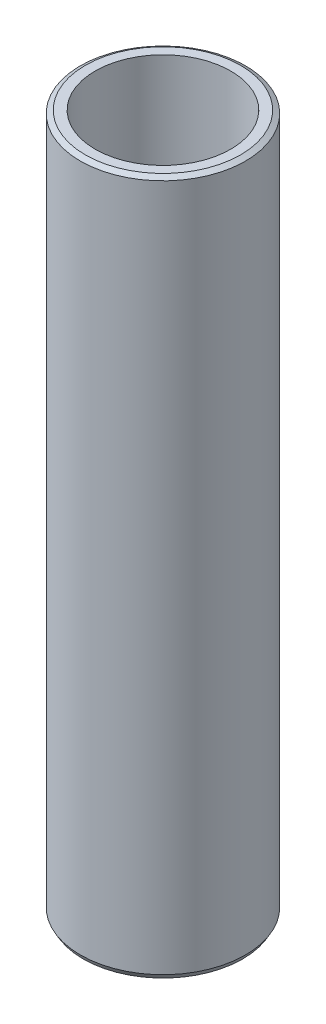
ISO-10303-21;
HEADER;
FILE_DESCRIPTION(('STEP AP214'),'2;1');
FILE_NAME('part.step','',(''),(''),'','','');
FILE_SCHEMA(('AUTOMOTIVE_DESIGN { 1 0 10303 214 1 1 1 1 }'));
ENDSEC;
DATA;
#1=APPLICATION_CONTEXT('core data for automotive mechanical design processes');
#2=APPLICATION_PROTOCOL_DEFINITION('international standard','automotive_design',2000,#1);
#3=PRODUCT_CONTEXT('',#1,'mechanical');
#4=PRODUCT('Part','Part','',(#3));
#5=PRODUCT_RELATED_PRODUCT_CATEGORY('part','',(#4));
#6=PRODUCT_DEFINITION_FORMATION('','',#4);
#7=PRODUCT_DEFINITION_CONTEXT('part definition',#1,'design');
#8=PRODUCT_DEFINITION('design','',#6,#7);
#9=PRODUCT_DEFINITION_SHAPE('','',#8);
#10=(LENGTH_UNIT() NAMED_UNIT(*) SI_UNIT(.MILLI.,.METRE.));
#11=(NAMED_UNIT(*) PLANE_ANGLE_UNIT() SI_UNIT($,.RADIAN.));
#12=(NAMED_UNIT(*) SI_UNIT($,.STERADIAN.) SOLID_ANGLE_UNIT());
#13=UNCERTAINTY_MEASURE_WITH_UNIT(LENGTH_MEASURE(1.E-05),#10,'distance_accuracy_value','');
#14=(GEOMETRIC_REPRESENTATION_CONTEXT(3) GLOBAL_UNCERTAINTY_ASSIGNED_CONTEXT((#13)) GLOBAL_UNIT_ASSIGNED_CONTEXT((#10,
#11,#12)) REPRESENTATION_CONTEXT('',''));
#15=CARTESIAN_POINT('',(0.,0.,0.));
#16=DIRECTION('',(0.,0.,1.));
#17=DIRECTION('',(1.,0.,0.));
#18=AXIS2_PLACEMENT_3D('',#15,#16,#17);
#19=CARTESIAN_POINT('',(0.,315.74827868934,0.));
#20=DIRECTION('',(0.,-1.,0.));
#21=DIRECTION('',(0.,0.,-1.));
#22=AXIS2_PLACEMENT_3D('',#19,#20,#21);
#23=CYLINDRICAL_SURFACE('',#22,37.5);
#24=CARTESIAN_POINT('',(0.,314.442957235542,0.));
#25=DIRECTION('',(0.,1.,0.));
#26=DIRECTION('',(0.,0.,1.));
#27=AXIS2_PLACEMENT_3D('',#24,#25,#26);
#28=CIRCLE('',#27,37.5);
#29=CARTESIAN_POINT('',(0.,314.442957235542,37.5));
#30=VERTEX_POINT('',#29);
#31=EDGE_CURVE('E50',#30,#30,#28,.F.);
#32=ORIENTED_EDGE('',*,*,#31,.T.);
#33=EDGE_LOOP('',(#32));
#34=FACE_BOUND('',#33,.T.);
#35=CARTESIAN_POINT('',(0.,2.26088307818717,0.));
#36=DIRECTION('',(0.,1.,0.));
#37=DIRECTION('',(0.,0.,1.));
#38=AXIS2_PLACEMENT_3D('',#35,#36,#37);
#39=CIRCLE('',#38,37.5);
#40=CARTESIAN_POINT('',(0.,2.26088307818717,37.5));
#41=VERTEX_POINT('',#40);
#42=EDGE_CURVE('E51',#41,#41,#39,.T.);
#43=ORIENTED_EDGE('',*,*,#42,.T.);
#44=EDGE_LOOP('',(#43));
#45=FACE_BOUND('',#44,.T.);
#46=ADVANCED_FACE('F39',(#34,#45),#23,.T.);
#47=CARTESIAN_POINT('',(0.,315.74827868934,0.));
#48=DIRECTION('',(0.,1.,0.));
#49=DIRECTION('',(0.,0.,1.));
#50=AXIS2_PLACEMENT_3D('',#47,#48,#49);
#51=PLANE('',#50);
#52=CARTESIAN_POINT('',(0.,315.74827868934,0.));
#53=DIRECTION('',(0.,1.,0.));
#54=DIRECTION('',(0.,0.,1.));
#55=AXIS2_PLACEMENT_3D('',#52,#53,#54);
#56=CIRCLE('',#55,35.2391169218127);
#57=CARTESIAN_POINT('',(0.,315.74827868934,35.2391169218127));
#58=VERTEX_POINT('',#57);
#59=EDGE_CURVE('E54',#58,#58,#56,.T.);
#60=ORIENTED_EDGE('',*,*,#59,.T.);
#61=EDGE_LOOP('',(#60));
#62=FACE_BOUND('',#61,.T.);
#63=CARTESIAN_POINT('',(0.,315.74827868934,0.));
#64=DIRECTION('',(0.,1.,0.));
#65=DIRECTION('',(0.,0.,1.));
#66=AXIS2_PLACEMENT_3D('',#63,#64,#65);
#67=CIRCLE('',#66,30.7841764514968);
#68=CARTESIAN_POINT('',(0.,315.74827868934,30.7841764514968));
#69=VERTEX_POINT('',#68);
#70=EDGE_CURVE('E58',#69,#69,#67,.T.);
#71=ORIENTED_EDGE('',*,*,#70,.F.);
#72=EDGE_LOOP('',(#71));
#73=FACE_BOUND('',#72,.T.);
#74=ADVANCED_FACE('F69',(#62,#73),#51,.T.);
#75=CARTESIAN_POINT('',(0.,0.,0.));
#76=DIRECTION('',(0.,1.,0.));
#77=DIRECTION('',(0.,0.,1.));
#78=AXIS2_PLACEMENT_3D('',#75,#76,#77);
#79=PLANE('',#78);
#80=CARTESIAN_POINT('',(0.,0.,0.));
#81=DIRECTION('',(0.,1.,0.));
#82=DIRECTION('',(0.,0.,1.));
#83=AXIS2_PLACEMENT_3D('',#80,#81,#82);
#84=CIRCLE('',#83,36.1946785462024);
#85=CARTESIAN_POINT('',(0.,0.,36.1946785462024));
#86=VERTEX_POINT('',#85);
#87=EDGE_CURVE('E10',#86,#86,#84,.F.);
#88=ORIENTED_EDGE('',*,*,#87,.T.);
#89=EDGE_LOOP('',(#88));
#90=FACE_BOUND('',#89,.T.);
#91=CARTESIAN_POINT('',(0.,0.,0.));
#92=DIRECTION('',(0.,1.,0.));
#93=DIRECTION('',(0.,0.,1.));
#94=AXIS2_PLACEMENT_3D('',#91,#92,#93);
#95=CIRCLE('',#94,30.7841764514968);
#96=CARTESIAN_POINT('',(0.,0.,30.7841764514968));
#97=VERTEX_POINT('',#96);
#98=EDGE_CURVE('E63',#97,#97,#95,.T.);
#99=ORIENTED_EDGE('',*,*,#98,.T.);
#100=EDGE_LOOP('',(#99));
#101=FACE_BOUND('',#100,.T.);
#102=ADVANCED_FACE('F75',(#90,#101),#79,.F.);
#103=CARTESIAN_POINT('',(0.,315.74827868934,0.));
#104=DIRECTION('',(0.,-1.,0.));
#105=DIRECTION('',(0.,0.,-1.));
#106=AXIS2_PLACEMENT_3D('',#103,#104,#105);
#107=CYLINDRICAL_SURFACE('',#106,30.7841764514968);
#108=ORIENTED_EDGE('',*,*,#70,.T.);
#109=EDGE_LOOP('',(#108));
#110=FACE_BOUND('',#109,.T.);
#111=ORIENTED_EDGE('',*,*,#98,.F.);
#112=EDGE_LOOP('',(#111));
#113=FACE_BOUND('',#112,.T.);
#114=ADVANCED_FACE('F70',(#110,#113),#107,.F.);
#115=CARTESIAN_POINT('',(0.,315.74827868934,0.));
#116=DIRECTION('',(0.,-1.,0.));
#117=DIRECTION('',(0.,0.,-1.));
#118=AXIS2_PLACEMENT_3D('',#115,#116,#117);
#119=CONICAL_SURFACE('',#118,35.2391169218127,1.0471975511966);
#120=ORIENTED_EDGE('',*,*,#31,.F.);
#121=EDGE_LOOP('',(#120));
#122=FACE_BOUND('',#121,.T.);
#123=ORIENTED_EDGE('',*,*,#59,.F.);
#124=EDGE_LOOP('',(#123));
#125=FACE_BOUND('',#124,.T.);
#126=ADVANCED_FACE('F81',(#122,#125),#119,.T.);
#127=CARTESIAN_POINT('',(0.,2.26088307818717,0.));
#128=DIRECTION('',(0.,1.,0.));
#129=DIRECTION('',(0.,0.,1.));
#130=AXIS2_PLACEMENT_3D('',#127,#128,#129);
#131=CONICAL_SURFACE('',#130,37.5,0.5235987755983);
#132=CARTESIAN_POINT('',(0.,0.,36.1946785462024));
#133=CARTESIAN_POINT('',(0.,0.0235508653977811,36.2082756446794));
#134=CARTESIAN_POINT('',(0.,0.0471017307955646,36.2218727431565));
#135=CARTESIAN_POINT('',(0.,0.0942034615911317,36.2490669401106));
#136=CARTESIAN_POINT('',(0.,0.117754326988915,36.2626640385877));
#137=CARTESIAN_POINT('',(0.,0.164856057784481,36.2898582355418));
#138=CARTESIAN_POINT('',(0.,0.188406923182264,36.3034553340188));
#139=CARTESIAN_POINT('',(0.,0.23550865397783,36.330649530973));
#140=CARTESIAN_POINT('',(0.,0.259059519375613,36.34424662945));
#141=CARTESIAN_POINT('',(0.,0.306161250171179,36.3714408264041));
#142=CARTESIAN_POINT('',(0.,0.329712115568961,36.3850379248812));
#143=CARTESIAN_POINT('',(0.,0.376813846364527,36.4122321218353));
#144=CARTESIAN_POINT('',(0.,0.400364711762311,36.4258292203124));
#145=CARTESIAN_POINT('',(0.,0.447466442557877,36.4530234172665));
#146=CARTESIAN_POINT('',(0.,0.47101730795566,36.4666205157435));
#147=CARTESIAN_POINT('',(0.,0.518119038751226,36.4938147126977));
#148=CARTESIAN_POINT('',(0.,0.541669904149009,36.5074118111747));
#149=CARTESIAN_POINT('',(0.,0.588771634944575,36.5346060081288));
#150=CARTESIAN_POINT('',(0.,0.612322500342357,36.5482031066059));
#151=CARTESIAN_POINT('',(0.,0.659424231137924,36.57539730356));
#152=CARTESIAN_POINT('',(0.,0.682975096535707,36.5889944020371));
#153=CARTESIAN_POINT('',(0.,0.730076827331274,36.6161885989912));
#154=CARTESIAN_POINT('',(0.,0.753627692729056,36.6297856974683));
#155=CARTESIAN_POINT('',(0.,0.800729423524622,36.6569798944224));
#156=CARTESIAN_POINT('',(0.,0.824280288922405,36.6705769928994));
#157=CARTESIAN_POINT('',(0.,0.871382019717971,36.6977711898535));
#158=CARTESIAN_POINT('',(0.,0.894932885115754,36.7113682883306));
#159=CARTESIAN_POINT('',(0.,0.94203461591132,36.7385624852847));
#160=CARTESIAN_POINT('',(0.,0.965585481309104,36.7521595837618));
#161=CARTESIAN_POINT('',(0.,1.01268721210467,36.7793537807159));
#162=CARTESIAN_POINT('',(0.,1.03623807750245,36.792950879193));
#163=CARTESIAN_POINT('',(0.,1.08333980829802,36.8201450761471));
#164=CARTESIAN_POINT('',(0.,1.1068906736958,36.8337421746241));
#165=CARTESIAN_POINT('',(0.,1.15399240449137,36.8609363715782));
#166=CARTESIAN_POINT('',(0.,1.17754326988915,36.8745334700553));
#167=CARTESIAN_POINT('',(0.,1.22464500068472,36.9017276670094));
#168=CARTESIAN_POINT('',(0.,1.2481958660825,36.9153247654865));
#169=CARTESIAN_POINT('',(0.,1.29529759687807,36.9425189624406));
#170=CARTESIAN_POINT('',(0.,1.31884846227585,36.9561160609177));
#171=CARTESIAN_POINT('',(0.,1.36595019307141,36.9833102578718));
#172=CARTESIAN_POINT('',(0.,1.3895010584692,36.9969073563488));
#173=CARTESIAN_POINT('',(0.,1.43660278926476,37.0241015533029));
#174=CARTESIAN_POINT('',(0.,1.46015365466255,37.03769865178));
#175=CARTESIAN_POINT('',(0.,1.50725538545811,37.0648928487341));
#176=CARTESIAN_POINT('',(0.,1.5308062508559,37.0784899472112));
#177=CARTESIAN_POINT('',(0.,1.57790798165146,37.1056841441653));
#178=CARTESIAN_POINT('',(0.,1.60145884704925,37.1192812426424));
#179=CARTESIAN_POINT('',(0.,1.64856057784481,37.1464754395965));
#180=CARTESIAN_POINT('',(0.,1.67211144324259,37.1600725380735));
#181=CARTESIAN_POINT('',(0.,1.71921317403816,37.1872667350277));
#182=CARTESIAN_POINT('',(0.,1.74276403943594,37.2008638335047));
#183=CARTESIAN_POINT('',(0.,1.78986577023151,37.2280580304588));
#184=CARTESIAN_POINT('',(0.,1.81341663562929,37.2416551289359));
#185=CARTESIAN_POINT('',(0.,1.86051836642486,37.26884932589));
#186=CARTESIAN_POINT('',(0.,1.88406923182264,37.2824464243671));
#187=CARTESIAN_POINT('',(0.,1.93117096261821,37.3096406213212));
#188=CARTESIAN_POINT('',(0.,1.95472182801599,37.3232377197982));
#189=CARTESIAN_POINT('',(0.,2.00182355881156,37.3504319167524));
#190=CARTESIAN_POINT('',(0.,2.02537442420934,37.3640290152294));
#191=CARTESIAN_POINT('',(0.,2.07247615500491,37.3912232121835));
#192=CARTESIAN_POINT('',(0.,2.09602702040269,37.4048203106606));
#193=CARTESIAN_POINT('',(0.,2.14312875119826,37.4320145076147));
#194=CARTESIAN_POINT('',(0.,2.16667961659604,37.4456116060918));
#195=CARTESIAN_POINT('',(0.,2.2137813473916,37.4728058030459));
#196=CARTESIAN_POINT('',(0.,2.23733221278939,37.486402901523));
#197=CARTESIAN_POINT('',(0.,2.26088307818717,37.5));
#198=B_SPLINE_CURVE_WITH_KNOTS('',3,(#132,#133,#134,#135,#136,#137,#138,#139,#140,#141,#142,
#143,#144,#145,#146,#147,#148,#149,#150,#151,#152,#153,#154,#155,#156,#157,#158,#159,#160,#161,
#162,#163,#164,#165,#166,#167,#168,#169,#170,#171,#172,#173,#174,#175,#176,#177,#178,#179,#180,
#181,#182,#183,#184,#185,#186,#187,#188,#189,#190,#191,#192,#193,#194,#195,#196,#197),
.UNSPECIFIED.,.F.,.F.,(4,2,2,2,2,2,2,2,2,2,2,2,2,2,2,2,2,2,2,2,2,2,2,2,2,2,2,2,2,2,2,2,4),(0.,
0.081582590862353,0.163165181724702,0.244747772587055,0.326330363449408,0.407912954311761,
0.489495545174111,0.571078136036464,0.652660726898816,0.734243317761169,0.815825908623519,
0.897408499485872,0.978991090348225,1.06057368121058,1.14215627207293,1.22373886293528,
1.30532145379763,1.38690404465999,1.46848663552234,1.55006922638469,1.63165181724704,
1.71323440810939,1.79481699897174,1.8763995898341,1.95798218069645,2.0395647715588,
2.12114736242115,2.20272995328351,2.28431254414586,2.36589513500821,2.44747772587056,
2.52906031673292,2.61064290759527),.UNSPECIFIED.);
#199=EDGE_CURVE('BSEAM45',#86,#41,#198,.T.);
#200=ORIENTED_EDGE('',*,*,#87,.F.);
#201=ORIENTED_EDGE('',*,*,#42,.F.);
#202=ORIENTED_EDGE('',*,*,#199,.T.);
#203=ORIENTED_EDGE('',*,*,#199,.F.);
#204=EDGE_LOOP('',(#200,#202,#201,#203));
#205=FACE_BOUND('',#204,.T.);
#206=ADVANCED_FACE('F45',(#205),#131,.T.);
#207=CLOSED_SHELL('',(#46,#74,#102,#114,#126,#206));
#208=MANIFOLD_SOLID_BREP('B2',#207);
#209=ADVANCED_BREP_SHAPE_REPRESENTATION('',(#18,#208),#14);
#210=SHAPE_DEFINITION_REPRESENTATION(#9,#209);
ENDSEC;
END-ISO-10303-21;
